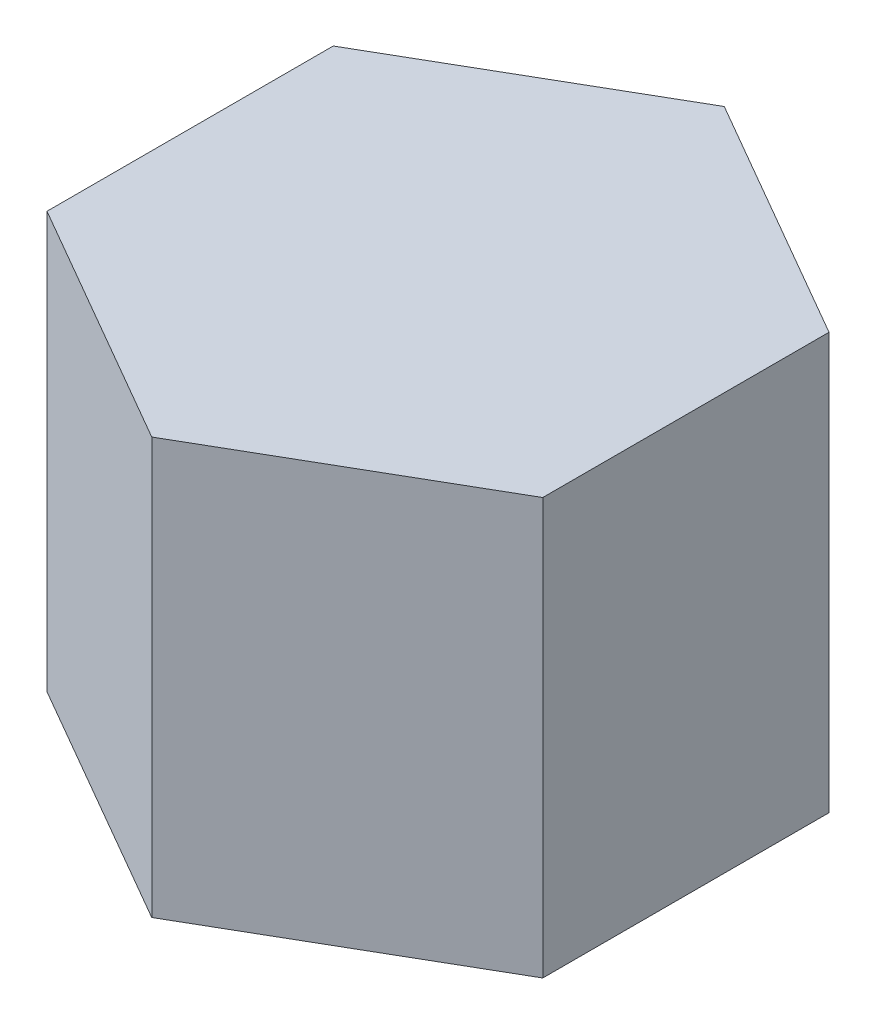
ISO-10303-21;
HEADER;
FILE_DESCRIPTION(('STEP AP214'),'2;1');
FILE_NAME('part.step','',(''),(''),'','','');
FILE_SCHEMA(('AUTOMOTIVE_DESIGN { 1 0 10303 214 1 1 1 1 }'));
ENDSEC;
DATA;
#1=APPLICATION_CONTEXT('core data for automotive mechanical design processes');
#2=APPLICATION_PROTOCOL_DEFINITION('international standard','automotive_design',2000,#1);
#3=PRODUCT_CONTEXT('',#1,'mechanical');
#4=PRODUCT('Part','Part','',(#3));
#5=PRODUCT_RELATED_PRODUCT_CATEGORY('part','',(#4));
#6=PRODUCT_DEFINITION_FORMATION('','',#4);
#7=PRODUCT_DEFINITION_CONTEXT('part definition',#1,'design');
#8=PRODUCT_DEFINITION('design','',#6,#7);
#9=PRODUCT_DEFINITION_SHAPE('','',#8);
#10=(LENGTH_UNIT() NAMED_UNIT(*) SI_UNIT(.MILLI.,.METRE.));
#11=(NAMED_UNIT(*) PLANE_ANGLE_UNIT() SI_UNIT($,.RADIAN.));
#12=(NAMED_UNIT(*) SI_UNIT($,.STERADIAN.) SOLID_ANGLE_UNIT());
#13=UNCERTAINTY_MEASURE_WITH_UNIT(LENGTH_MEASURE(1.E-05),#10,'distance_accuracy_value','');
#14=(GEOMETRIC_REPRESENTATION_CONTEXT(3) GLOBAL_UNCERTAINTY_ASSIGNED_CONTEXT((#13)) GLOBAL_UNIT_ASSIGNED_CONTEXT((#10,
#11,#12)) REPRESENTATION_CONTEXT('',''));
#15=CARTESIAN_POINT('',(0.,0.,0.));
#16=DIRECTION('',(0.,0.,1.));
#17=DIRECTION('',(1.,0.,0.));
#18=AXIS2_PLACEMENT_3D('',#15,#16,#17);
#19=CARTESIAN_POINT('',(204.839551417382,-147.556598747966,289.083895009141));
#20=DIRECTION('',(-0.499999999999943,0.,-0.866025403784471));
#21=DIRECTION('',(-0.866025403784471,0.,0.499999999999943));
#22=AXIS2_PLACEMENT_3D('',#19,#20,#21);
#23=PLANE('',#22);
#24=CARTESIAN_POINT('',(205.142660308706,-147.047793579175,288.908895009141));
#25=DIRECTION('',(-0.866025403784471,0.,0.499999999999943));
#26=VECTOR('',#25,1.);
#27=LINE('',#24,#26);
#28=CARTESIAN_POINT('',(205.142660308706,-147.047793579175,288.908895009141));
#29=VERTEX_POINT('',#28);
#30=CARTESIAN_POINT('',(204.839551417382,-147.047793579175,289.083895009141));
#31=VERTEX_POINT('',#30);
#32=EDGE_CURVE('E170',#29,#31,#27,.T.);
#33=ORIENTED_EDGE('',*,*,#32,.T.);
#34=CARTESIAN_POINT('',(204.839551417382,-147.556598747966,289.083895009141));
#35=DIRECTION('',(0.,1.,0.));
#36=VECTOR('',#35,1.);
#37=LINE('',#34,#36);
#38=CARTESIAN_POINT('',(204.839551417382,-147.556598747966,289.083895009141));
#39=VERTEX_POINT('',#38);
#40=EDGE_CURVE('E35',#39,#31,#37,.T.);
#41=ORIENTED_EDGE('',*,*,#40,.F.);
#42=CARTESIAN_POINT('',(205.142660308706,-147.556598747966,288.908895009141));
#43=DIRECTION('',(-0.866025403784471,0.,0.499999999999943));
#44=VECTOR('',#43,1.);
#45=LINE('',#42,#44);
#46=CARTESIAN_POINT('',(205.142660308706,-147.556598747966,288.908895009141));
#47=VERTEX_POINT('',#46);
#48=EDGE_CURVE('E159',#47,#39,#45,.T.);
#49=ORIENTED_EDGE('',*,*,#48,.F.);
#50=CARTESIAN_POINT('',(205.142660308706,-147.556598747966,288.908895009141));
#51=DIRECTION('',(0.,1.,0.));
#52=VECTOR('',#51,1.);
#53=LINE('',#50,#52);
#54=EDGE_CURVE('E10',#47,#29,#53,.T.);
#55=ORIENTED_EDGE('',*,*,#54,.T.);
#56=EDGE_LOOP('',(#33,#41,#49,#55));
#57=FACE_BOUND('',#56,.T.);
#58=ADVANCED_FACE('F16',(#57),#23,.F.);
#59=CARTESIAN_POINT('',(205.142660308706,-147.556598747966,291.594471220494));
#60=DIRECTION('',(-1.,0.,0.));
#61=DIRECTION('',(0.,-1.,0.));
#62=AXIS2_PLACEMENT_3D('',#59,#60,#61);
#63=PLANE('',#62);
#64=CARTESIAN_POINT('',(205.142660308706,-147.047793579175,288.558895009141));
#65=DIRECTION('',(0.,0.,1.));
#66=VECTOR('',#65,1.);
#67=LINE('',#64,#66);
#68=CARTESIAN_POINT('',(205.142660308706,-147.047793579175,288.558895009141));
#69=VERTEX_POINT('',#68);
#70=EDGE_CURVE('E167',#69,#29,#67,.T.);
#71=ORIENTED_EDGE('',*,*,#70,.T.);
#72=ORIENTED_EDGE('',*,*,#54,.F.);
#73=CARTESIAN_POINT('',(205.142660308706,-147.556598747966,288.558895009141));
#74=DIRECTION('',(0.,0.,1.));
#75=VECTOR('',#74,1.);
#76=LINE('',#73,#75);
#77=CARTESIAN_POINT('',(205.142660308706,-147.556598747966,288.558895009141));
#78=VERTEX_POINT('',#77);
#79=EDGE_CURVE('E156',#78,#47,#76,.T.);
#80=ORIENTED_EDGE('',*,*,#79,.F.);
#81=CARTESIAN_POINT('',(205.142660308706,-147.556598747966,288.558895009141));
#82=DIRECTION('',(0.,1.,0.));
#83=VECTOR('',#82,1.);
#84=LINE('',#81,#83);
#85=EDGE_CURVE('E27',#78,#69,#84,.T.);
#86=ORIENTED_EDGE('',*,*,#85,.T.);
#87=EDGE_LOOP('',(#71,#72,#80,#86));
#88=FACE_BOUND('',#87,.T.);
#89=ADVANCED_FACE('F189',(#88),#63,.F.);
#90=CARTESIAN_POINT('',(205.142660308706,-147.556598747966,288.558895009141));
#91=DIRECTION('',(-0.499999999999943,0.,0.866025403784471));
#92=DIRECTION('',(0.866025403784471,0.,0.499999999999943));
#93=AXIS2_PLACEMENT_3D('',#90,#91,#92);
#94=PLANE('',#93);
#95=CARTESIAN_POINT('',(204.839551417382,-147.047793579175,288.383895009141));
#96=DIRECTION('',(0.866025403784471,0.,0.499999999999943));
#97=VECTOR('',#96,1.);
#98=LINE('',#95,#97);
#99=CARTESIAN_POINT('',(204.839551417382,-147.047793579175,288.383895009141));
#100=VERTEX_POINT('',#99);
#101=EDGE_CURVE('E163',#100,#69,#98,.T.);
#102=ORIENTED_EDGE('',*,*,#101,.T.);
#103=ORIENTED_EDGE('',*,*,#85,.F.);
#104=CARTESIAN_POINT('',(204.839551417382,-147.556598747966,288.383895009141));
#105=DIRECTION('',(0.866025403784471,0.,0.499999999999943));
#106=VECTOR('',#105,1.);
#107=LINE('',#104,#106);
#108=CARTESIAN_POINT('',(204.839551417382,-147.556598747966,288.383895009141));
#109=VERTEX_POINT('',#108);
#110=EDGE_CURVE('E106',#109,#78,#107,.T.);
#111=ORIENTED_EDGE('',*,*,#110,.F.);
#112=CARTESIAN_POINT('',(204.839551417382,-147.556598747966,288.383895009141));
#113=DIRECTION('',(0.,1.,0.));
#114=VECTOR('',#113,1.);
#115=LINE('',#112,#114);
#116=EDGE_CURVE('E94',#109,#100,#115,.T.);
#117=ORIENTED_EDGE('',*,*,#116,.T.);
#118=EDGE_LOOP('',(#102,#103,#111,#117));
#119=FACE_BOUND('',#118,.T.);
#120=ADVANCED_FACE('F198',(#119),#94,.F.);
#121=CARTESIAN_POINT('',(204.839551417382,-147.556598747966,288.383895009141));
#122=DIRECTION('',(0.499999999999978,0.,0.866025403784452));
#123=DIRECTION('',(0.866025403784452,0.,-0.499999999999978));
#124=AXIS2_PLACEMENT_3D('',#121,#122,#123);
#125=PLANE('',#124);
#126=CARTESIAN_POINT('',(204.536442526057,-147.047793579175,288.558895009141));
#127=DIRECTION('',(0.866025403784452,0.,-0.499999999999978));
#128=VECTOR('',#127,1.);
#129=LINE('',#126,#128);
#130=CARTESIAN_POINT('',(204.536442526057,-147.047793579175,288.558895009141));
#131=VERTEX_POINT('',#130);
#132=EDGE_CURVE('E162',#131,#100,#129,.T.);
#133=ORIENTED_EDGE('',*,*,#132,.T.);
#134=ORIENTED_EDGE('',*,*,#116,.F.);
#135=CARTESIAN_POINT('',(204.536442526057,-147.556598747966,288.558895009141));
#136=DIRECTION('',(0.866025403784452,0.,-0.499999999999978));
#137=VECTOR('',#136,1.);
#138=LINE('',#135,#137);
#139=CARTESIAN_POINT('',(204.536442526057,-147.556598747966,288.558895009141));
#140=VERTEX_POINT('',#139);
#141=EDGE_CURVE('E98',#140,#109,#138,.T.);
#142=ORIENTED_EDGE('',*,*,#141,.F.);
#143=CARTESIAN_POINT('',(204.536442526057,-147.556598747966,288.558895009141));
#144=DIRECTION('',(0.,1.,0.));
#145=VECTOR('',#144,1.);
#146=LINE('',#143,#145);
#147=EDGE_CURVE('E79',#140,#131,#146,.T.);
#148=ORIENTED_EDGE('',*,*,#147,.T.);
#149=EDGE_LOOP('',(#133,#134,#142,#148));
#150=FACE_BOUND('',#149,.T.);
#151=ADVANCED_FACE('F100',(#150),#125,.F.);
#152=CARTESIAN_POINT('',(204.536442526057,-147.556598747966,291.594471220494));
#153=DIRECTION('',(1.,0.,0.));
#154=DIRECTION('',(0.,1.,0.));
#155=AXIS2_PLACEMENT_3D('',#152,#153,#154);
#156=PLANE('',#155);
#157=CARTESIAN_POINT('',(204.536442526057,-147.047793579175,288.908895009141));
#158=DIRECTION('',(0.,0.,-1.));
#159=VECTOR('',#158,1.);
#160=LINE('',#157,#159);
#161=CARTESIAN_POINT('',(204.536442526057,-147.047793579175,288.908895009141));
#162=VERTEX_POINT('',#161);
#163=EDGE_CURVE('E88',#162,#131,#160,.T.);
#164=ORIENTED_EDGE('',*,*,#163,.T.);
#165=ORIENTED_EDGE('',*,*,#147,.F.);
#166=CARTESIAN_POINT('',(204.536442526057,-147.556598747966,288.908895009141));
#167=DIRECTION('',(0.,0.,-1.));
#168=VECTOR('',#167,1.);
#169=LINE('',#166,#168);
#170=CARTESIAN_POINT('',(204.536442526057,-147.556598747966,288.908895009141));
#171=VERTEX_POINT('',#170);
#172=EDGE_CURVE('E84',#171,#140,#169,.T.);
#173=ORIENTED_EDGE('',*,*,#172,.F.);
#174=CARTESIAN_POINT('',(204.536442526057,-147.556598747966,288.908895009141));
#175=DIRECTION('',(0.,1.,0.));
#176=VECTOR('',#175,1.);
#177=LINE('',#174,#176);
#178=EDGE_CURVE('E58',#171,#162,#177,.T.);
#179=ORIENTED_EDGE('',*,*,#178,.T.);
#180=EDGE_LOOP('',(#164,#165,#173,#179));
#181=FACE_BOUND('',#180,.T.);
#182=ADVANCED_FACE('F82',(#181),#156,.F.);
#183=CARTESIAN_POINT('',(204.536442526057,-147.556598747966,288.908895009141));
#184=DIRECTION('',(0.499999999999943,0.,-0.866025403784471));
#185=DIRECTION('',(-0.866025403784471,0.,-0.499999999999943));
#186=AXIS2_PLACEMENT_3D('',#183,#184,#185);
#187=PLANE('',#186);
#188=CARTESIAN_POINT('',(204.839551417382,-147.047793579175,289.083895009141));
#189=DIRECTION('',(-0.866025403784471,0.,-0.499999999999943));
#190=VECTOR('',#189,1.);
#191=LINE('',#188,#190);
#192=EDGE_CURVE('E160',#31,#162,#191,.T.);
#193=ORIENTED_EDGE('',*,*,#192,.T.);
#194=ORIENTED_EDGE('',*,*,#178,.F.);
#195=CARTESIAN_POINT('',(204.839551417382,-147.556598747966,289.083895009141));
#196=DIRECTION('',(-0.866025403784471,0.,-0.499999999999943));
#197=VECTOR('',#196,1.);
#198=LINE('',#195,#197);
#199=EDGE_CURVE('E112',#39,#171,#198,.T.);
#200=ORIENTED_EDGE('',*,*,#199,.F.);
#201=ORIENTED_EDGE('',*,*,#40,.T.);
#202=EDGE_LOOP('',(#193,#194,#200,#201));
#203=FACE_BOUND('',#202,.T.);
#204=ADVANCED_FACE('F131',(#203),#187,.F.);
#205=CARTESIAN_POINT('',(206.491105863044,-147.556598747966,291.594471220494));
#206=DIRECTION('',(0.,1.,0.));
#207=DIRECTION('',(-1.,0.,0.));
#208=AXIS2_PLACEMENT_3D('',#205,#206,#207);
#209=PLANE('',#208);
#210=ORIENTED_EDGE('',*,*,#48,.T.);
#211=ORIENTED_EDGE('',*,*,#199,.T.);
#212=ORIENTED_EDGE('',*,*,#172,.T.);
#213=ORIENTED_EDGE('',*,*,#141,.T.);
#214=ORIENTED_EDGE('',*,*,#110,.T.);
#215=ORIENTED_EDGE('',*,*,#79,.T.);
#216=EDGE_LOOP('',(#210,#211,#212,#213,#214,#215));
#217=FACE_BOUND('',#216,.T.);
#218=ADVANCED_FACE('F111',(#217),#209,.F.);
#219=CARTESIAN_POINT('',(206.491105863044,-147.047793579175,291.594471220494));
#220=DIRECTION('',(0.,1.,0.));
#221=DIRECTION('',(-1.,0.,0.));
#222=AXIS2_PLACEMENT_3D('',#219,#220,#221);
#223=PLANE('',#222);
#224=ORIENTED_EDGE('',*,*,#32,.F.);
#225=ORIENTED_EDGE('',*,*,#70,.F.);
#226=ORIENTED_EDGE('',*,*,#101,.F.);
#227=ORIENTED_EDGE('',*,*,#132,.F.);
#228=ORIENTED_EDGE('',*,*,#163,.F.);
#229=ORIENTED_EDGE('',*,*,#192,.F.);
#230=EDGE_LOOP('',(#224,#225,#226,#227,#228,#229));
#231=FACE_BOUND('',#230,.T.);
#232=ADVANCED_FACE('F130',(#231),#223,.T.);
#233=CLOSED_SHELL('',(#58,#89,#120,#151,#182,#204,#218,#232));
#234=MANIFOLD_SOLID_BREP('B1',#233);
#235=ADVANCED_BREP_SHAPE_REPRESENTATION('',(#18,#234),#14);
#236=SHAPE_DEFINITION_REPRESENTATION(#9,#235);
ENDSEC;
END-ISO-10303-21;
